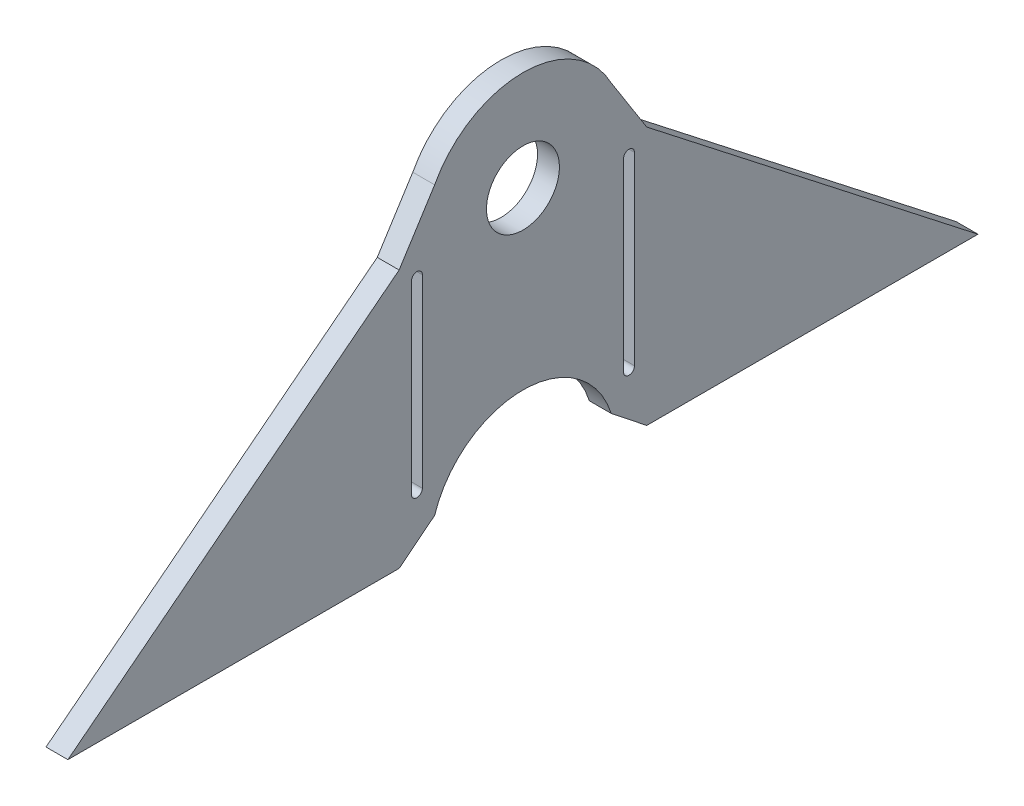
ISO-10303-21;
HEADER;
FILE_DESCRIPTION(('STEP AP214'),'2;1');
FILE_NAME('part.step','',(''),(''),'','','');
FILE_SCHEMA(('AUTOMOTIVE_DESIGN { 1 0 10303 214 1 1 1 1 }'));
ENDSEC;
DATA;
#1=APPLICATION_CONTEXT('core data for automotive mechanical design processes');
#2=APPLICATION_PROTOCOL_DEFINITION('international standard','automotive_design',2000,#1);
#3=PRODUCT_CONTEXT('',#1,'mechanical');
#4=PRODUCT('Part','Part','',(#3));
#5=PRODUCT_RELATED_PRODUCT_CATEGORY('part','',(#4));
#6=PRODUCT_DEFINITION_FORMATION('','',#4);
#7=PRODUCT_DEFINITION_CONTEXT('part definition',#1,'design');
#8=PRODUCT_DEFINITION('design','',#6,#7);
#9=PRODUCT_DEFINITION_SHAPE('','',#8);
#10=(LENGTH_UNIT() NAMED_UNIT(*) SI_UNIT(.MILLI.,.METRE.));
#11=(NAMED_UNIT(*) PLANE_ANGLE_UNIT() SI_UNIT($,.RADIAN.));
#12=(NAMED_UNIT(*) SI_UNIT($,.STERADIAN.) SOLID_ANGLE_UNIT());
#13=UNCERTAINTY_MEASURE_WITH_UNIT(LENGTH_MEASURE(1.E-05),#10,'distance_accuracy_value','');
#14=(GEOMETRIC_REPRESENTATION_CONTEXT(3) GLOBAL_UNCERTAINTY_ASSIGNED_CONTEXT((#13)) GLOBAL_UNIT_ASSIGNED_CONTEXT((#10,
#11,#12)) REPRESENTATION_CONTEXT('',''));
#15=CARTESIAN_POINT('',(0.,0.,0.));
#16=DIRECTION('',(0.,0.,1.));
#17=DIRECTION('',(1.,0.,0.));
#18=AXIS2_PLACEMENT_3D('',#15,#16,#17);
#19=CARTESIAN_POINT('',(3.,0.,0.));
#20=DIRECTION('',(-1.,0.,0.));
#21=DIRECTION('',(0.,0.,1.));
#22=AXIS2_PLACEMENT_3D('',#19,#20,#21);
#23=CYLINDRICAL_SURFACE('',#22,12.7);
#24=DIRECTION('',(1.,0.,0.));
#25=VECTOR('',#24,1.);
#26=CARTESIAN_POINT('',(1.5,3.85746030439718,12.1));
#27=LINE('',#26,#25);
#28=CARTESIAN_POINT('',(0.,3.85746030439718,12.1));
#29=VERTEX_POINT('',#28);
#30=CARTESIAN_POINT('',(3.,3.85746030439719,12.1));
#31=VERTEX_POINT('',#30);
#32=EDGE_CURVE('E306',#29,#31,#27,.T.);
#33=ORIENTED_EDGE('',*,*,#32,.F.);
#34=CARTESIAN_POINT('',(0.,0.,0.));
#35=DIRECTION('',(-1.,0.,0.));
#36=DIRECTION('',(0.,0.,1.));
#37=AXIS2_PLACEMENT_3D('',#34,#35,#36);
#38=CIRCLE('',#37,12.7);
#39=CARTESIAN_POINT('',(0.,3.85746030439718,-12.1));
#40=VERTEX_POINT('',#39);
#41=EDGE_CURVE('E275',#29,#40,#38,.T.);
#42=ORIENTED_EDGE('',*,*,#41,.T.);
#43=DIRECTION('',(-1.,0.,0.));
#44=VECTOR('',#43,1.);
#45=CARTESIAN_POINT('',(3.,3.85746030439718,-12.1));
#46=LINE('',#45,#44);
#47=CARTESIAN_POINT('',(3.,3.85746030439718,-12.1));
#48=VERTEX_POINT('',#47);
#49=EDGE_CURVE('E53',#40,#48,#46,.F.);
#50=ORIENTED_EDGE('',*,*,#49,.T.);
#51=CARTESIAN_POINT('',(3.,0.,0.));
#52=DIRECTION('',(-1.,0.,0.));
#53=DIRECTION('',(0.,0.,-1.));
#54=AXIS2_PLACEMENT_3D('',#51,#52,#53);
#55=CIRCLE('',#54,12.7);
#56=EDGE_CURVE('E270',#31,#48,#55,.T.);
#57=ORIENTED_EDGE('',*,*,#56,.F.);
#58=EDGE_LOOP('',(#33,#42,#50,#57));
#59=FACE_BOUND('',#58,.T.);
#60=ADVANCED_FACE('F44',(#59),#23,.F.);
#61=CARTESIAN_POINT('',(3.,36.67,0.));
#62=DIRECTION('',(1.,0.,0.));
#63=DIRECTION('',(0.,0.,-1.));
#64=AXIS2_PLACEMENT_3D('',#61,#62,#63);
#65=CYLINDRICAL_SURFACE('',#64,13.7);
#66=DIRECTION('',(1.,0.,0.));
#67=VECTOR('',#66,1.);
#68=CARTESIAN_POINT('',(1.5,43.0949513616836,-12.1));
#69=LINE('',#68,#67);
#70=CARTESIAN_POINT('',(0.,43.0949513616836,-12.1));
#71=VERTEX_POINT('',#70);
#72=CARTESIAN_POINT('',(3.,43.0949513616836,-12.1));
#73=VERTEX_POINT('',#72);
#74=EDGE_CURVE('E12',#71,#73,#69,.T.);
#75=ORIENTED_EDGE('',*,*,#74,.F.);
#76=CARTESIAN_POINT('',(0.,36.67,0.));
#77=DIRECTION('',(1.,0.,0.));
#78=DIRECTION('',(0.,0.,-1.));
#79=AXIS2_PLACEMENT_3D('',#76,#77,#78);
#80=CIRCLE('',#79,13.7);
#81=CARTESIAN_POINT('',(0.,43.0949513616836,12.1));
#82=VERTEX_POINT('',#81);
#83=EDGE_CURVE('E277',#71,#82,#80,.T.);
#84=ORIENTED_EDGE('',*,*,#83,.T.);
#85=DIRECTION('',(1.,0.,0.));
#86=VECTOR('',#85,1.);
#87=CARTESIAN_POINT('',(3.,43.0949513616836,12.1));
#88=LINE('',#87,#86);
#89=CARTESIAN_POINT('',(3.,43.0949513616836,12.1));
#90=VERTEX_POINT('',#89);
#91=EDGE_CURVE('E269',#82,#90,#88,.T.);
#92=ORIENTED_EDGE('',*,*,#91,.T.);
#93=CARTESIAN_POINT('',(3.,36.67,0.));
#94=DIRECTION('',(1.,0.,0.));
#95=DIRECTION('',(0.,0.,1.));
#96=AXIS2_PLACEMENT_3D('',#93,#94,#95);
#97=CIRCLE('',#96,13.7);
#98=EDGE_CURVE('E274',#73,#90,#97,.T.);
#99=ORIENTED_EDGE('',*,*,#98,.F.);
#100=EDGE_LOOP('',(#75,#84,#92,#99));
#101=FACE_BOUND('',#100,.T.);
#102=ADVANCED_FACE('F344',(#101),#65,.T.);
#103=CARTESIAN_POINT('',(3.,36.67,0.));
#104=DIRECTION('',(1.,0.,0.));
#105=DIRECTION('',(0.,0.,-1.));
#106=AXIS2_PLACEMENT_3D('',#103,#104,#105);
#107=CYLINDRICAL_SURFACE('',#106,5.);
#108=CARTESIAN_POINT('',(3.,36.67,0.));
#109=DIRECTION('',(1.,0.,0.));
#110=DIRECTION('',(0.,0.,-1.));
#111=AXIS2_PLACEMENT_3D('',#108,#109,#110);
#112=CIRCLE('',#111,5.);
#113=CARTESIAN_POINT('',(3.,36.67,-5.));
#114=VERTEX_POINT('',#113);
#115=EDGE_CURVE('E266',#114,#114,#112,.T.);
#116=ORIENTED_EDGE('',*,*,#115,.T.);
#117=EDGE_LOOP('',(#116));
#118=FACE_BOUND('',#117,.T.);
#119=CARTESIAN_POINT('',(0.,36.67,0.));
#120=DIRECTION('',(1.,0.,0.));
#121=DIRECTION('',(0.,0.,-1.));
#122=AXIS2_PLACEMENT_3D('',#119,#120,#121);
#123=CIRCLE('',#122,5.);
#124=CARTESIAN_POINT('',(0.,36.67,-5.));
#125=VERTEX_POINT('',#124);
#126=EDGE_CURVE('E271',#125,#125,#123,.T.);
#127=ORIENTED_EDGE('',*,*,#126,.F.);
#128=EDGE_LOOP('',(#127));
#129=FACE_BOUND('',#128,.T.);
#130=ADVANCED_FACE('F374',(#118,#129),#107,.F.);
#131=CARTESIAN_POINT('',(3.,36.67,0.));
#132=DIRECTION('',(-1.,0.,0.));
#133=DIRECTION('',(0.,0.,1.));
#134=AXIS2_PLACEMENT_3D('',#131,#132,#133);
#135=PLANE('',#134);
#136=DIRECTION('',(0.,-1.,0.));
#137=VECTOR('',#136,1.);
#138=CARTESIAN_POINT('',(3.,7.92873015219859,13.7847343065321));
#139=LINE('',#138,#137);
#140=CARTESIAN_POINT('',(3.,33.2583054680759,13.7847343065321));
#141=VERTEX_POINT('',#140);
#142=CARTESIAN_POINT('',(3.,7.92873015219859,13.7847343065321));
#143=VERTEX_POINT('',#142);
#144=EDGE_CURVE('E179',#141,#143,#139,.T.);
#145=ORIENTED_EDGE('',*,*,#144,.T.);
#146=CARTESIAN_POINT('',(3.,7.92873015219859,14.5347343065321));
#147=DIRECTION('',(-1.,0.,0.));
#148=DIRECTION('',(0.,0.,-1.));
#149=AXIS2_PLACEMENT_3D('',#146,#147,#148);
#150=CIRCLE('',#149,0.749999999999997);
#151=CARTESIAN_POINT('',(3.,7.92873015219859,15.2847343065321));
#152=VERTEX_POINT('',#151);
#153=EDGE_CURVE('E173',#143,#152,#150,.T.);
#154=ORIENTED_EDGE('',*,*,#153,.T.);
#155=DIRECTION('',(0.,1.,0.));
#156=VECTOR('',#155,1.);
#157=CARTESIAN_POINT('',(3.,7.92873015219859,15.2847343065321));
#158=LINE('',#157,#156);
#159=CARTESIAN_POINT('',(3.,33.2583054680759,15.2847343065321));
#160=VERTEX_POINT('',#159);
#161=EDGE_CURVE('E182',#152,#160,#158,.T.);
#162=ORIENTED_EDGE('',*,*,#161,.T.);
#163=CARTESIAN_POINT('',(3.,33.2583054680759,14.5347343065321));
#164=DIRECTION('',(-1.,0.,0.));
#165=DIRECTION('',(0.,0.,-1.));
#166=AXIS2_PLACEMENT_3D('',#163,#164,#165);
#167=CIRCLE('',#166,0.749999999999997);
#168=EDGE_CURVE('E61',#160,#141,#167,.T.);
#169=ORIENTED_EDGE('',*,*,#168,.T.);
#170=EDGE_LOOP('',(#145,#154,#162,#169));
#171=FACE_BOUND('',#170,.T.);
#172=DIRECTION('',(0.,-1.,0.));
#173=VECTOR('',#172,1.);
#174=CARTESIAN_POINT('',(3.,7.9287301521986,-15.2847343065321));
#175=LINE('',#174,#173);
#176=CARTESIAN_POINT('',(3.,33.2583054680759,-15.2847343065321));
#177=VERTEX_POINT('',#176);
#178=CARTESIAN_POINT('',(3.,7.9287301521986,-15.2847343065321));
#179=VERTEX_POINT('',#178);
#180=EDGE_CURVE('E217',#177,#179,#175,.T.);
#181=ORIENTED_EDGE('',*,*,#180,.T.);
#182=CARTESIAN_POINT('',(3.,7.9287301521986,-14.5347343065321));
#183=DIRECTION('',(-1.,0.,0.));
#184=DIRECTION('',(0.,0.,1.));
#185=AXIS2_PLACEMENT_3D('',#182,#183,#184);
#186=CIRCLE('',#185,0.749999999999997);
#187=CARTESIAN_POINT('',(3.,7.9287301521986,-13.7847343065321));
#188=VERTEX_POINT('',#187);
#189=EDGE_CURVE('E207',#179,#188,#186,.T.);
#190=ORIENTED_EDGE('',*,*,#189,.T.);
#191=DIRECTION('',(0.,1.,0.));
#192=VECTOR('',#191,1.);
#193=CARTESIAN_POINT('',(3.,7.9287301521986,-13.7847343065321));
#194=LINE('',#193,#192);
#195=CARTESIAN_POINT('',(3.,33.2583054680759,-13.7847343065321));
#196=VERTEX_POINT('',#195);
#197=EDGE_CURVE('E210',#188,#196,#194,.T.);
#198=ORIENTED_EDGE('',*,*,#197,.T.);
#199=CARTESIAN_POINT('',(3.,33.2583054680759,-14.5347343065321));
#200=DIRECTION('',(-1.,0.,0.));
#201=DIRECTION('',(0.,0.,1.));
#202=AXIS2_PLACEMENT_3D('',#199,#200,#201);
#203=CIRCLE('',#202,0.749999999999997);
#204=EDGE_CURVE('E214',#196,#177,#203,.T.);
#205=ORIENTED_EDGE('',*,*,#204,.T.);
#206=EDGE_LOOP('',(#181,#190,#198,#205));
#207=FACE_BOUND('',#206,.T.);
#208=ORIENTED_EDGE('',*,*,#98,.T.);
#209=DIRECTION('',(0.,-0.844335414105345,0.535814994646059));
#210=VECTOR('',#209,1.);
#211=CARTESIAN_POINT('',(3.,43.0949513616836,12.1));
#212=LINE('',#211,#210);
#213=CARTESIAN_POINT('',(3.,35.4216595744681,16.9694686130642));
#214=VERTEX_POINT('',#213);
#215=EDGE_CURVE('E284',#90,#214,#212,.T.);
#216=ORIENTED_EDGE('',*,*,#215,.T.);
#217=DIRECTION('',(0.,-0.615136088972758,0.788420948506126));
#218=VECTOR('',#217,1.);
#219=CARTESIAN_POINT('',(3.,0.,62.3694686130642));
#220=LINE('',#219,#218);
#221=CARTESIAN_POINT('',(3.,0.,62.3694686130642));
#222=VERTEX_POINT('',#221);
#223=EDGE_CURVE('E260',#214,#222,#220,.T.);
#224=ORIENTED_EDGE('',*,*,#223,.T.);
#225=DIRECTION('',(0.,0.,-1.));
#226=VECTOR('',#225,1.);
#227=CARTESIAN_POINT('',(3.,0.,12.3694686130642));
#228=LINE('',#227,#226);
#229=CARTESIAN_POINT('',(3.,0.,16.9694686130642));
#230=VERTEX_POINT('',#229);
#231=EDGE_CURVE('E263',#222,#230,#228,.T.);
#232=ORIENTED_EDGE('',*,*,#231,.T.);
#233=DIRECTION('',(0.,0.620946769944341,-0.783852734189075));
#234=VECTOR('',#233,1.);
#235=CARTESIAN_POINT('',(3.,0.,16.9694686130642));
#236=LINE('',#235,#234);
#237=EDGE_CURVE('E279',#230,#31,#236,.T.);
#238=ORIENTED_EDGE('',*,*,#237,.T.);
#239=ORIENTED_EDGE('',*,*,#56,.T.);
#240=DIRECTION('',(0.,-0.620946769944341,-0.783852734189076));
#241=VECTOR('',#240,1.);
#242=CARTESIAN_POINT('',(3.,3.85746030439719,-12.1));
#243=LINE('',#242,#241);
#244=CARTESIAN_POINT('',(3.,0.,-16.9694686130642));
#245=VERTEX_POINT('',#244);
#246=EDGE_CURVE('E296',#48,#245,#243,.T.);
#247=ORIENTED_EDGE('',*,*,#246,.T.);
#248=DIRECTION('',(0.,0.,1.));
#249=VECTOR('',#248,1.);
#250=CARTESIAN_POINT('',(3.,0.,-12.3694686130642));
#251=LINE('',#250,#249);
#252=CARTESIAN_POINT('',(3.,0.,-62.3694686130642));
#253=VERTEX_POINT('',#252);
#254=EDGE_CURVE('E248',#253,#245,#251,.T.);
#255=ORIENTED_EDGE('',*,*,#254,.F.);
#256=DIRECTION('',(0.,-0.615136088972758,-0.788420948506126));
#257=VECTOR('',#256,1.);
#258=CARTESIAN_POINT('',(3.,0.,-62.3694686130642));
#259=LINE('',#258,#257);
#260=CARTESIAN_POINT('',(3.,35.4216595744681,-16.9694686130642));
#261=VERTEX_POINT('',#260);
#262=EDGE_CURVE('E238',#261,#253,#259,.T.);
#263=ORIENTED_EDGE('',*,*,#262,.F.);
#264=DIRECTION('',(0.,0.844335414105345,0.535814994646058));
#265=VECTOR('',#264,1.);
#266=CARTESIAN_POINT('',(3.,35.4216595744681,-16.9694686130642));
#267=LINE('',#266,#265);
#268=EDGE_CURVE('E293',#261,#73,#267,.T.);
#269=ORIENTED_EDGE('',*,*,#268,.T.);
#270=EDGE_LOOP('',(#208,#216,#224,#232,#238,#239,#247,#255,#263,#269));
#271=FACE_BOUND('',#270,.T.);
#272=ORIENTED_EDGE('',*,*,#115,.F.);
#273=EDGE_LOOP('',(#272));
#274=FACE_BOUND('',#273,.T.);
#275=ADVANCED_FACE('F46',(#171,#207,#271,#274),#135,.F.);
#276=CARTESIAN_POINT('',(0.,36.67,0.));
#277=DIRECTION('',(-1.,0.,0.));
#278=DIRECTION('',(0.,0.,1.));
#279=AXIS2_PLACEMENT_3D('',#276,#277,#278);
#280=PLANE('',#279);
#281=CARTESIAN_POINT('',(0.,7.92873015219859,14.5347343065321));
#282=DIRECTION('',(-1.,0.,0.));
#283=DIRECTION('',(0.,0.,-1.));
#284=AXIS2_PLACEMENT_3D('',#281,#282,#283);
#285=CIRCLE('',#284,0.749999999999997);
#286=CARTESIAN_POINT('',(0.,7.92873015219859,13.7847343065321));
#287=VERTEX_POINT('',#286);
#288=CARTESIAN_POINT('',(0.,7.92873015219859,15.2847343065321));
#289=VERTEX_POINT('',#288);
#290=EDGE_CURVE('E69',#287,#289,#285,.T.);
#291=ORIENTED_EDGE('',*,*,#290,.F.);
#292=DIRECTION('',(0.,-1.,0.));
#293=VECTOR('',#292,1.);
#294=CARTESIAN_POINT('',(0.,7.92873015219859,13.7847343065321));
#295=LINE('',#294,#293);
#296=CARTESIAN_POINT('',(0.,33.2583054680759,13.7847343065321));
#297=VERTEX_POINT('',#296);
#298=EDGE_CURVE('E188',#297,#287,#295,.T.);
#299=ORIENTED_EDGE('',*,*,#298,.F.);
#300=CARTESIAN_POINT('',(0.,33.2583054680759,14.5347343065321));
#301=DIRECTION('',(-1.,0.,0.));
#302=DIRECTION('',(0.,0.,-1.));
#303=AXIS2_PLACEMENT_3D('',#300,#301,#302);
#304=CIRCLE('',#303,0.749999999999997);
#305=CARTESIAN_POINT('',(0.,33.2583054680759,15.2847343065321));
#306=VERTEX_POINT('',#305);
#307=EDGE_CURVE('E191',#306,#297,#304,.T.);
#308=ORIENTED_EDGE('',*,*,#307,.F.);
#309=DIRECTION('',(0.,1.,0.));
#310=VECTOR('',#309,1.);
#311=CARTESIAN_POINT('',(0.,7.92873015219859,15.2847343065321));
#312=LINE('',#311,#310);
#313=EDGE_CURVE('E197',#289,#306,#312,.T.);
#314=ORIENTED_EDGE('',*,*,#313,.F.);
#315=EDGE_LOOP('',(#291,#299,#308,#314));
#316=FACE_BOUND('',#315,.T.);
#317=CARTESIAN_POINT('',(0.,7.9287301521986,-14.5347343065321));
#318=DIRECTION('',(-1.,0.,0.));
#319=DIRECTION('',(0.,0.,1.));
#320=AXIS2_PLACEMENT_3D('',#317,#318,#319);
#321=CIRCLE('',#320,0.749999999999997);
#322=CARTESIAN_POINT('',(0.,7.9287301521986,-15.2847343065321));
#323=VERTEX_POINT('',#322);
#324=CARTESIAN_POINT('',(0.,7.9287301521986,-13.7847343065321));
#325=VERTEX_POINT('',#324);
#326=EDGE_CURVE('E203',#323,#325,#321,.T.);
#327=ORIENTED_EDGE('',*,*,#326,.F.);
#328=DIRECTION('',(0.,-1.,0.));
#329=VECTOR('',#328,1.);
#330=CARTESIAN_POINT('',(0.,7.9287301521986,-15.2847343065321));
#331=LINE('',#330,#329);
#332=CARTESIAN_POINT('',(0.,33.2583054680759,-15.2847343065321));
#333=VERTEX_POINT('',#332);
#334=EDGE_CURVE('E211',#333,#323,#331,.T.);
#335=ORIENTED_EDGE('',*,*,#334,.F.);
#336=CARTESIAN_POINT('',(0.,33.2583054680759,-14.5347343065321));
#337=DIRECTION('',(-1.,0.,0.));
#338=DIRECTION('',(0.,0.,1.));
#339=AXIS2_PLACEMENT_3D('',#336,#337,#338);
#340=CIRCLE('',#339,0.749999999999997);
#341=CARTESIAN_POINT('',(0.,33.2583054680759,-13.7847343065321));
#342=VERTEX_POINT('',#341);
#343=EDGE_CURVE('E225',#342,#333,#340,.T.);
#344=ORIENTED_EDGE('',*,*,#343,.F.);
#345=DIRECTION('',(0.,1.,0.));
#346=VECTOR('',#345,1.);
#347=CARTESIAN_POINT('',(0.,7.9287301521986,-13.7847343065321));
#348=LINE('',#347,#346);
#349=EDGE_CURVE('E222',#325,#342,#348,.T.);
#350=ORIENTED_EDGE('',*,*,#349,.F.);
#351=EDGE_LOOP('',(#327,#335,#344,#350));
#352=FACE_BOUND('',#351,.T.);
#353=ORIENTED_EDGE('',*,*,#83,.F.);
#354=DIRECTION('',(0.,0.844335414105345,0.535814994646058));
#355=VECTOR('',#354,1.);
#356=CARTESIAN_POINT('',(0.,35.4216595744681,-16.9694686130642));
#357=LINE('',#356,#355);
#358=CARTESIAN_POINT('',(0.,35.4216595744681,-16.9694686130642));
#359=VERTEX_POINT('',#358);
#360=EDGE_CURVE('E297',#359,#71,#357,.T.);
#361=ORIENTED_EDGE('',*,*,#360,.F.);
#362=DIRECTION('',(0.,-0.615136088972758,-0.788420948506126));
#363=VECTOR('',#362,1.);
#364=CARTESIAN_POINT('',(0.,0.,-62.3694686130642));
#365=LINE('',#364,#363);
#366=CARTESIAN_POINT('',(0.,0.,-62.3694686130642));
#367=VERTEX_POINT('',#366);
#368=EDGE_CURVE('E245',#359,#367,#365,.T.);
#369=ORIENTED_EDGE('',*,*,#368,.T.);
#370=DIRECTION('',(0.,0.,-1.));
#371=VECTOR('',#370,1.);
#372=CARTESIAN_POINT('',(0.,0.,-12.3694686130642));
#373=LINE('',#372,#371);
#374=CARTESIAN_POINT('',(0.,0.,-16.9694686130642));
#375=VERTEX_POINT('',#374);
#376=EDGE_CURVE('E243',#367,#375,#373,.F.);
#377=ORIENTED_EDGE('',*,*,#376,.T.);
#378=DIRECTION('',(0.,-0.620946769944341,-0.783852734189076));
#379=VECTOR('',#378,1.);
#380=CARTESIAN_POINT('',(0.,3.85746030439719,-12.1));
#381=LINE('',#380,#379);
#382=EDGE_CURVE('E241',#40,#375,#381,.T.);
#383=ORIENTED_EDGE('',*,*,#382,.F.);
#384=ORIENTED_EDGE('',*,*,#41,.F.);
#385=DIRECTION('',(0.,0.620946769944341,-0.783852734189075));
#386=VECTOR('',#385,1.);
#387=CARTESIAN_POINT('',(0.,0.,16.9694686130642));
#388=LINE('',#387,#386);
#389=CARTESIAN_POINT('',(0.,0.,16.9694686130642));
#390=VERTEX_POINT('',#389);
#391=EDGE_CURVE('E285',#390,#29,#388,.T.);
#392=ORIENTED_EDGE('',*,*,#391,.F.);
#393=DIRECTION('',(0.,0.,-1.));
#394=VECTOR('',#393,1.);
#395=CARTESIAN_POINT('',(0.,0.,12.3694686130642));
#396=LINE('',#395,#394);
#397=CARTESIAN_POINT('',(0.,0.,62.3694686130642));
#398=VERTEX_POINT('',#397);
#399=EDGE_CURVE('E252',#398,#390,#396,.T.);
#400=ORIENTED_EDGE('',*,*,#399,.F.);
#401=DIRECTION('',(0.,-0.615136088972758,0.788420948506126));
#402=VECTOR('',#401,1.);
#403=CARTESIAN_POINT('',(0.,0.,62.3694686130642));
#404=LINE('',#403,#402);
#405=CARTESIAN_POINT('',(0.,35.4216595744681,16.9694686130641));
#406=VERTEX_POINT('',#405);
#407=EDGE_CURVE('E257',#406,#398,#404,.T.);
#408=ORIENTED_EDGE('',*,*,#407,.F.);
#409=DIRECTION('',(0.,-0.844335414105345,0.535814994646059));
#410=VECTOR('',#409,1.);
#411=CARTESIAN_POINT('',(0.,43.0949513616836,12.1));
#412=LINE('',#411,#410);
#413=EDGE_CURVE('E288',#82,#406,#412,.T.);
#414=ORIENTED_EDGE('',*,*,#413,.F.);
#415=EDGE_LOOP('',(#353,#361,#369,#377,#383,#384,#392,#400,#408,#414));
#416=FACE_BOUND('',#415,.T.);
#417=ORIENTED_EDGE('',*,*,#126,.T.);
#418=EDGE_LOOP('',(#417));
#419=FACE_BOUND('',#418,.T.);
#420=ADVANCED_FACE('F337',(#316,#352,#416,#419),#280,.T.);
#421=CARTESIAN_POINT('',(1.5,43.0949513616836,12.1));
#422=DIRECTION('',(0.,0.535814994646059,0.844335414105345));
#423=DIRECTION('',(0.,-0.844335414105345,0.535814994646059));
#424=AXIS2_PLACEMENT_3D('',#421,#422,#423);
#425=PLANE('',#424);
#426=ORIENTED_EDGE('',*,*,#91,.F.);
#427=ORIENTED_EDGE('',*,*,#413,.T.);
#428=DIRECTION('',(1.,0.,0.));
#429=VECTOR('',#428,1.);
#430=CARTESIAN_POINT('',(1.5,35.4216595744681,16.9694686130642));
#431=LINE('',#430,#429);
#432=EDGE_CURVE('E265',#406,#214,#431,.T.);
#433=ORIENTED_EDGE('',*,*,#432,.T.);
#434=ORIENTED_EDGE('',*,*,#215,.F.);
#435=EDGE_LOOP('',(#426,#427,#433,#434));
#436=FACE_BOUND('',#435,.T.);
#437=ADVANCED_FACE('F347',(#436),#425,.T.);
#438=CARTESIAN_POINT('',(1.5,0.,16.9694686130642));
#439=DIRECTION('',(0.,-0.783852734189075,-0.620946769944341));
#440=DIRECTION('',(0.,0.620946769944341,-0.783852734189075));
#441=AXIS2_PLACEMENT_3D('',#438,#439,#440);
#442=PLANE('',#441);
#443=ORIENTED_EDGE('',*,*,#391,.T.);
#444=ORIENTED_EDGE('',*,*,#32,.T.);
#445=ORIENTED_EDGE('',*,*,#237,.F.);
#446=DIRECTION('',(1.,0.,0.));
#447=VECTOR('',#446,1.);
#448=CARTESIAN_POINT('',(3.,0.,16.9694686130642));
#449=LINE('',#448,#447);
#450=EDGE_CURVE('E254',#390,#230,#449,.T.);
#451=ORIENTED_EDGE('',*,*,#450,.F.);
#452=EDGE_LOOP('',(#443,#444,#445,#451));
#453=FACE_BOUND('',#452,.T.);
#454=ADVANCED_FACE('F357',(#453),#442,.T.);
#455=CARTESIAN_POINT('',(3.,0.,62.3694686130642));
#456=DIRECTION('',(0.,0.788420948506126,0.615136088972758));
#457=DIRECTION('',(0.,-0.615136088972758,0.788420948506126));
#458=AXIS2_PLACEMENT_3D('',#455,#456,#457);
#459=PLANE('',#458);
#460=ORIENTED_EDGE('',*,*,#432,.F.);
#461=ORIENTED_EDGE('',*,*,#407,.T.);
#462=DIRECTION('',(1.,0.,0.));
#463=VECTOR('',#462,1.);
#464=CARTESIAN_POINT('',(3.,0.,62.3694686130642));
#465=LINE('',#464,#463);
#466=EDGE_CURVE('E255',#398,#222,#465,.T.);
#467=ORIENTED_EDGE('',*,*,#466,.T.);
#468=ORIENTED_EDGE('',*,*,#223,.F.);
#469=EDGE_LOOP('',(#460,#461,#467,#468));
#470=FACE_BOUND('',#469,.T.);
#471=ADVANCED_FACE('F359',(#470),#459,.T.);
#472=CARTESIAN_POINT('',(3.,0.,12.3694686130642));
#473=DIRECTION('',(0.,-1.,0.));
#474=DIRECTION('',(0.,0.,-1.));
#475=AXIS2_PLACEMENT_3D('',#472,#473,#474);
#476=PLANE('',#475);
#477=ORIENTED_EDGE('',*,*,#466,.F.);
#478=ORIENTED_EDGE('',*,*,#399,.T.);
#479=ORIENTED_EDGE('',*,*,#450,.T.);
#480=ORIENTED_EDGE('',*,*,#231,.F.);
#481=EDGE_LOOP('',(#477,#478,#479,#480));
#482=FACE_BOUND('',#481,.T.);
#483=ADVANCED_FACE('F352',(#482),#476,.T.);
#484=CARTESIAN_POINT('',(1.5,3.85746030439719,-12.1));
#485=DIRECTION('',(0.,-0.783852734189076,0.620946769944341));
#486=DIRECTION('',(0.,-0.620946769944341,-0.783852734189076));
#487=AXIS2_PLACEMENT_3D('',#484,#485,#486);
#488=PLANE('',#487);
#489=ORIENTED_EDGE('',*,*,#49,.F.);
#490=ORIENTED_EDGE('',*,*,#382,.T.);
#491=DIRECTION('',(1.,0.,0.));
#492=VECTOR('',#491,1.);
#493=CARTESIAN_POINT('',(1.5,0.,-16.9694686130642));
#494=LINE('',#493,#492);
#495=EDGE_CURVE('E48',#375,#245,#494,.T.);
#496=ORIENTED_EDGE('',*,*,#495,.T.);
#497=ORIENTED_EDGE('',*,*,#246,.F.);
#498=EDGE_LOOP('',(#489,#490,#496,#497));
#499=FACE_BOUND('',#498,.T.);
#500=ADVANCED_FACE('F334',(#499),#488,.T.);
#501=CARTESIAN_POINT('',(1.5,35.4216595744681,-16.9694686130642));
#502=DIRECTION('',(0.,0.535814994646058,-0.844335414105345));
#503=DIRECTION('',(0.,0.844335414105345,0.535814994646058));
#504=AXIS2_PLACEMENT_3D('',#501,#502,#503);
#505=PLANE('',#504);
#506=ORIENTED_EDGE('',*,*,#360,.T.);
#507=ORIENTED_EDGE('',*,*,#74,.T.);
#508=ORIENTED_EDGE('',*,*,#268,.F.);
#509=DIRECTION('',(1.,0.,0.));
#510=VECTOR('',#509,1.);
#511=CARTESIAN_POINT('',(3.,35.4216595744681,-16.9694686130641));
#512=LINE('',#511,#510);
#513=EDGE_CURVE('E242',#359,#261,#512,.T.);
#514=ORIENTED_EDGE('',*,*,#513,.F.);
#515=EDGE_LOOP('',(#506,#507,#508,#514));
#516=FACE_BOUND('',#515,.T.);
#517=ADVANCED_FACE('F321',(#516),#505,.T.);
#518=CARTESIAN_POINT('',(3.,0.,-12.3694686130642));
#519=DIRECTION('',(0.,1.,0.));
#520=DIRECTION('',(0.,0.,1.));
#521=AXIS2_PLACEMENT_3D('',#518,#519,#520);
#522=PLANE('',#521);
#523=ORIENTED_EDGE('',*,*,#495,.F.);
#524=ORIENTED_EDGE('',*,*,#376,.F.);
#525=DIRECTION('',(1.,0.,0.));
#526=VECTOR('',#525,1.);
#527=CARTESIAN_POINT('',(3.,0.,-62.3694686130642));
#528=LINE('',#527,#526);
#529=EDGE_CURVE('E250',#367,#253,#528,.T.);
#530=ORIENTED_EDGE('',*,*,#529,.T.);
#531=ORIENTED_EDGE('',*,*,#254,.T.);
#532=EDGE_LOOP('',(#523,#524,#530,#531));
#533=FACE_BOUND('',#532,.T.);
#534=ADVANCED_FACE('F330',(#533),#522,.F.);
#535=CARTESIAN_POINT('',(3.,0.,-62.3694686130642));
#536=DIRECTION('',(0.,-0.788420948506126,0.615136088972758));
#537=DIRECTION('',(0.,-0.615136088972758,-0.788420948506126));
#538=AXIS2_PLACEMENT_3D('',#535,#536,#537);
#539=PLANE('',#538);
#540=ORIENTED_EDGE('',*,*,#529,.F.);
#541=ORIENTED_EDGE('',*,*,#368,.F.);
#542=ORIENTED_EDGE('',*,*,#513,.T.);
#543=ORIENTED_EDGE('',*,*,#262,.T.);
#544=EDGE_LOOP('',(#540,#541,#542,#543));
#545=FACE_BOUND('',#544,.T.);
#546=ADVANCED_FACE('F318',(#545),#539,.F.);
#547=CARTESIAN_POINT('',(3.,7.9287301521986,-14.5347343065321));
#548=DIRECTION('',(-1.,0.,0.));
#549=DIRECTION('',(0.,0.,1.));
#550=AXIS2_PLACEMENT_3D('',#547,#548,#549);
#551=CYLINDRICAL_SURFACE('',#550,0.749999999999997);
#552=ORIENTED_EDGE('',*,*,#326,.T.);
#553=DIRECTION('',(-1.,0.,0.));
#554=VECTOR('',#553,1.);
#555=CARTESIAN_POINT('',(3.,7.9287301521986,-13.7847343065321));
#556=LINE('',#555,#554);
#557=EDGE_CURVE('E220',#188,#325,#556,.T.);
#558=ORIENTED_EDGE('',*,*,#557,.F.);
#559=ORIENTED_EDGE('',*,*,#189,.F.);
#560=DIRECTION('',(-1.,0.,0.));
#561=VECTOR('',#560,1.);
#562=CARTESIAN_POINT('',(3.,7.9287301521986,-15.2847343065321));
#563=LINE('',#562,#561);
#564=EDGE_CURVE('E230',#179,#323,#563,.T.);
#565=ORIENTED_EDGE('',*,*,#564,.T.);
#566=EDGE_LOOP('',(#552,#558,#559,#565));
#567=FACE_BOUND('',#566,.T.);
#568=ADVANCED_FACE('F398',(#567),#551,.F.);
#569=CARTESIAN_POINT('',(3.,7.9287301521986,-15.2847343065321));
#570=DIRECTION('',(0.,0.,-1.));
#571=DIRECTION('',(0.,1.,0.));
#572=AXIS2_PLACEMENT_3D('',#569,#570,#571);
#573=PLANE('',#572);
#574=ORIENTED_EDGE('',*,*,#334,.T.);
#575=ORIENTED_EDGE('',*,*,#564,.F.);
#576=ORIENTED_EDGE('',*,*,#180,.F.);
#577=DIRECTION('',(-1.,0.,0.));
#578=VECTOR('',#577,1.);
#579=CARTESIAN_POINT('',(3.,33.2583054680759,-15.2847343065321));
#580=LINE('',#579,#578);
#581=EDGE_CURVE('E232',#177,#333,#580,.T.);
#582=ORIENTED_EDGE('',*,*,#581,.T.);
#583=EDGE_LOOP('',(#574,#575,#576,#582));
#584=FACE_BOUND('',#583,.T.);
#585=ADVANCED_FACE('F406',(#584),#573,.F.);
#586=CARTESIAN_POINT('',(3.,33.2583054680759,-14.5347343065321));
#587=DIRECTION('',(-1.,0.,0.));
#588=DIRECTION('',(0.,0.,1.));
#589=AXIS2_PLACEMENT_3D('',#586,#587,#588);
#590=CYLINDRICAL_SURFACE('',#589,0.749999999999997);
#591=ORIENTED_EDGE('',*,*,#343,.T.);
#592=ORIENTED_EDGE('',*,*,#581,.F.);
#593=ORIENTED_EDGE('',*,*,#204,.F.);
#594=DIRECTION('',(-1.,0.,0.));
#595=VECTOR('',#594,1.);
#596=CARTESIAN_POINT('',(3.,33.2583054680759,-13.7847343065321));
#597=LINE('',#596,#595);
#598=EDGE_CURVE('E234',#196,#342,#597,.T.);
#599=ORIENTED_EDGE('',*,*,#598,.T.);
#600=EDGE_LOOP('',(#591,#592,#593,#599));
#601=FACE_BOUND('',#600,.T.);
#602=ADVANCED_FACE('F408',(#601),#590,.F.);
#603=CARTESIAN_POINT('',(3.,7.9287301521986,-13.7847343065321));
#604=DIRECTION('',(0.,0.,1.));
#605=DIRECTION('',(0.,-1.,0.));
#606=AXIS2_PLACEMENT_3D('',#603,#604,#605);
#607=PLANE('',#606);
#608=ORIENTED_EDGE('',*,*,#349,.T.);
#609=ORIENTED_EDGE('',*,*,#598,.F.);
#610=ORIENTED_EDGE('',*,*,#197,.F.);
#611=ORIENTED_EDGE('',*,*,#557,.T.);
#612=EDGE_LOOP('',(#608,#609,#610,#611));
#613=FACE_BOUND('',#612,.T.);
#614=ADVANCED_FACE('F402',(#613),#607,.F.);
#615=CARTESIAN_POINT('',(3.,7.92873015219859,14.5347343065321));
#616=DIRECTION('',(-1.,0.,0.));
#617=DIRECTION('',(0.,0.,1.));
#618=AXIS2_PLACEMENT_3D('',#615,#616,#617);
#619=CYLINDRICAL_SURFACE('',#618,0.749999999999997);
#620=ORIENTED_EDGE('',*,*,#290,.T.);
#621=DIRECTION('',(-1.,0.,0.));
#622=VECTOR('',#621,1.);
#623=CARTESIAN_POINT('',(3.,7.92873015219859,15.2847343065321));
#624=LINE('',#623,#622);
#625=EDGE_CURVE('E169',#152,#289,#624,.T.);
#626=ORIENTED_EDGE('',*,*,#625,.F.);
#627=ORIENTED_EDGE('',*,*,#153,.F.);
#628=DIRECTION('',(-1.,0.,0.));
#629=VECTOR('',#628,1.);
#630=CARTESIAN_POINT('',(3.,7.92873015219859,13.7847343065321));
#631=LINE('',#630,#629);
#632=EDGE_CURVE('E201',#143,#287,#631,.T.);
#633=ORIENTED_EDGE('',*,*,#632,.T.);
#634=EDGE_LOOP('',(#620,#626,#627,#633));
#635=FACE_BOUND('',#634,.T.);
#636=ADVANCED_FACE('F171',(#635),#619,.F.);
#637=CARTESIAN_POINT('',(3.,7.92873015219859,13.7847343065321));
#638=DIRECTION('',(0.,0.,-1.));
#639=DIRECTION('',(0.,1.,0.));
#640=AXIS2_PLACEMENT_3D('',#637,#638,#639);
#641=PLANE('',#640);
#642=ORIENTED_EDGE('',*,*,#298,.T.);
#643=ORIENTED_EDGE('',*,*,#632,.F.);
#644=ORIENTED_EDGE('',*,*,#144,.F.);
#645=DIRECTION('',(-1.,0.,0.));
#646=VECTOR('',#645,1.);
#647=CARTESIAN_POINT('',(3.,33.2583054680759,13.7847343065321));
#648=LINE('',#647,#646);
#649=EDGE_CURVE('E204',#141,#297,#648,.T.);
#650=ORIENTED_EDGE('',*,*,#649,.T.);
#651=EDGE_LOOP('',(#642,#643,#644,#650));
#652=FACE_BOUND('',#651,.T.);
#653=ADVANCED_FACE('F467',(#652),#641,.F.);
#654=CARTESIAN_POINT('',(3.,33.2583054680759,14.5347343065321));
#655=DIRECTION('',(-1.,0.,0.));
#656=DIRECTION('',(0.,0.,1.));
#657=AXIS2_PLACEMENT_3D('',#654,#655,#656);
#658=CYLINDRICAL_SURFACE('',#657,0.749999999999997);
#659=ORIENTED_EDGE('',*,*,#307,.T.);
#660=ORIENTED_EDGE('',*,*,#649,.F.);
#661=ORIENTED_EDGE('',*,*,#168,.F.);
#662=DIRECTION('',(-1.,0.,0.));
#663=VECTOR('',#662,1.);
#664=CARTESIAN_POINT('',(3.,33.2583054680759,15.2847343065321));
#665=LINE('',#664,#663);
#666=EDGE_CURVE('E178',#160,#306,#665,.T.);
#667=ORIENTED_EDGE('',*,*,#666,.T.);
#668=EDGE_LOOP('',(#659,#660,#661,#667));
#669=FACE_BOUND('',#668,.T.);
#670=ADVANCED_FACE('F475',(#669),#658,.F.);
#671=CARTESIAN_POINT('',(3.,7.92873015219859,15.2847343065321));
#672=DIRECTION('',(0.,0.,1.));
#673=DIRECTION('',(0.,-1.,0.));
#674=AXIS2_PLACEMENT_3D('',#671,#672,#673);
#675=PLANE('',#674);
#676=ORIENTED_EDGE('',*,*,#313,.T.);
#677=ORIENTED_EDGE('',*,*,#666,.F.);
#678=ORIENTED_EDGE('',*,*,#161,.F.);
#679=ORIENTED_EDGE('',*,*,#625,.T.);
#680=EDGE_LOOP('',(#676,#677,#678,#679));
#681=FACE_BOUND('',#680,.T.);
#682=ADVANCED_FACE('F183',(#681),#675,.F.);
#683=CLOSED_SHELL('',(#60,#102,#130,#275,#420,#437,#454,#471,#483,#500,#517,#534,#546,#568,#585,
#602,#614,#636,#653,#670,#682));
#684=MANIFOLD_SOLID_BREP('B2',#683);
#685=ADVANCED_BREP_SHAPE_REPRESENTATION('',(#18,#684),#14);
#686=SHAPE_DEFINITION_REPRESENTATION(#9,#685);
ENDSEC;
END-ISO-10303-21;
